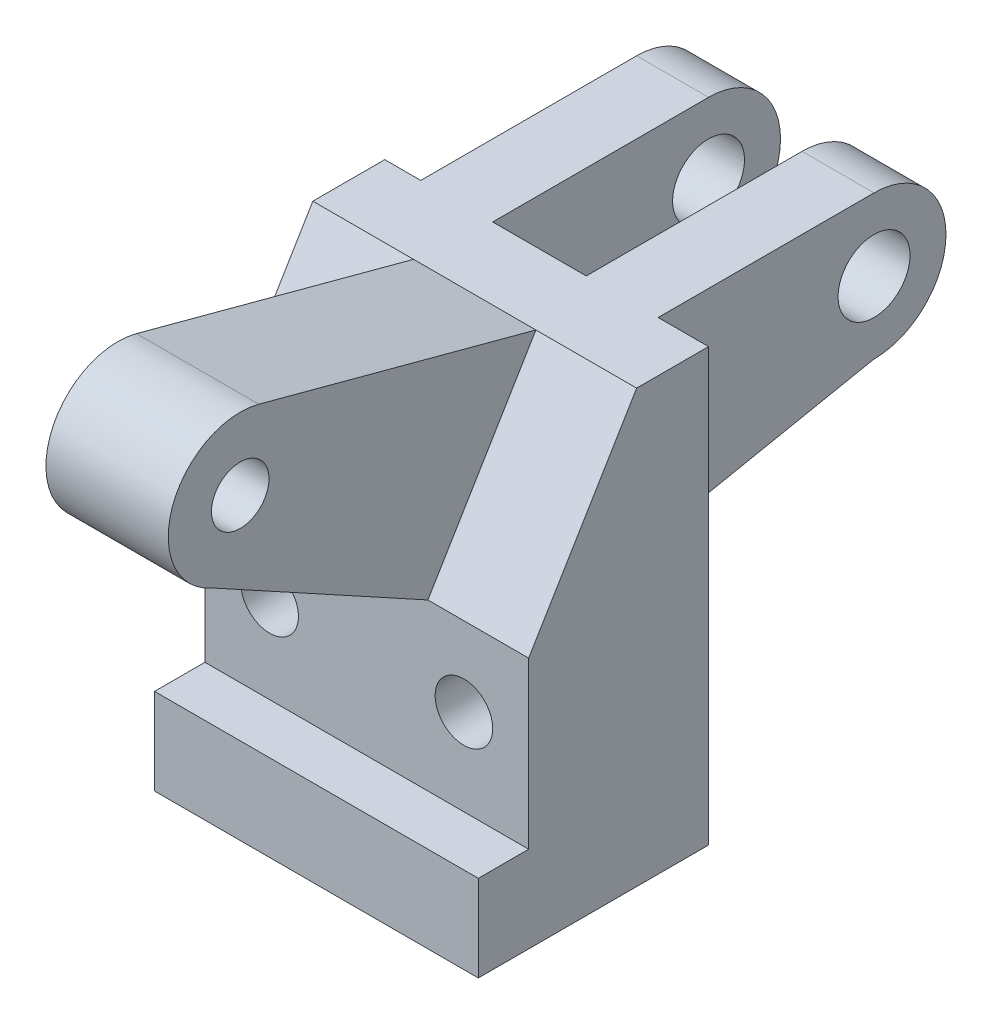
ISO-10303-21;
HEADER;
FILE_DESCRIPTION(('STEP AP214'),'2;1');
FILE_NAME('part.step','',(''),(''),'','','');
FILE_SCHEMA(('AUTOMOTIVE_DESIGN { 1 0 10303 214 1 1 1 1 }'));
ENDSEC;
DATA;
#1=APPLICATION_CONTEXT('core data for automotive mechanical design processes');
#2=APPLICATION_PROTOCOL_DEFINITION('international standard','automotive_design',2000,#1);
#3=PRODUCT_CONTEXT('',#1,'mechanical');
#4=PRODUCT('Part','Part','',(#3));
#5=PRODUCT_RELATED_PRODUCT_CATEGORY('part','',(#4));
#6=PRODUCT_DEFINITION_FORMATION('','',#4);
#7=PRODUCT_DEFINITION_CONTEXT('part definition',#1,'design');
#8=PRODUCT_DEFINITION('design','',#6,#7);
#9=PRODUCT_DEFINITION_SHAPE('','',#8);
#10=(LENGTH_UNIT() NAMED_UNIT(*) SI_UNIT(.MILLI.,.METRE.));
#11=(NAMED_UNIT(*) PLANE_ANGLE_UNIT() SI_UNIT($,.RADIAN.));
#12=(NAMED_UNIT(*) SI_UNIT($,.STERADIAN.) SOLID_ANGLE_UNIT());
#13=UNCERTAINTY_MEASURE_WITH_UNIT(LENGTH_MEASURE(1.E-05),#10,'distance_accuracy_value','');
#14=(GEOMETRIC_REPRESENTATION_CONTEXT(3) GLOBAL_UNCERTAINTY_ASSIGNED_CONTEXT((#13)) GLOBAL_UNIT_ASSIGNED_CONTEXT((#10,
#11,#12)) REPRESENTATION_CONTEXT('',''));
#15=CARTESIAN_POINT('',(0.,0.,0.));
#16=DIRECTION('',(0.,0.,1.));
#17=DIRECTION('',(1.,0.,0.));
#18=AXIS2_PLACEMENT_3D('',#15,#16,#17);
#19=CARTESIAN_POINT('',(1143.,1524.,254.));
#20=DIRECTION('',(0.,0.514495755427527,0.857492925712544));
#21=DIRECTION('',(0.,-0.857492925712544,0.514495755427527));
#22=AXIS2_PLACEMENT_3D('',#19,#20,#21);
#23=PLANE('',#22);
#24=DIRECTION('',(1.,0.,0.));
#25=VECTOR('',#24,1.);
#26=CARTESIAN_POINT('',(1143.,889.,635.));
#27=LINE('',#26,#25);
#28=CARTESIAN_POINT('',(0.,889.,635.));
#29=VERTEX_POINT('',#28);
#30=CARTESIAN_POINT('',(355.6,889.,635.));
#31=VERTEX_POINT('',#30);
#32=EDGE_CURVE('E215',#29,#31,#27,.T.);
#33=ORIENTED_EDGE('',*,*,#32,.T.);
#34=DIRECTION('',(0.,0.857492925712544,-0.514495755427527));
#35=VECTOR('',#34,1.);
#36=CARTESIAN_POINT('',(355.6,1524.,254.));
#37=LINE('',#36,#35);
#38=CARTESIAN_POINT('',(355.6,1524.,254.));
#39=VERTEX_POINT('',#38);
#40=EDGE_CURVE('E338',#31,#39,#37,.T.);
#41=ORIENTED_EDGE('',*,*,#40,.T.);
#42=DIRECTION('',(-1.,0.,0.));
#43=VECTOR('',#42,1.);
#44=CARTESIAN_POINT('',(1143.,1524.,254.));
#45=LINE('',#44,#43);
#46=CARTESIAN_POINT('',(0.,1524.,254.));
#47=VERTEX_POINT('',#46);
#48=EDGE_CURVE('E200',#39,#47,#45,.T.);
#49=ORIENTED_EDGE('',*,*,#48,.T.);
#50=DIRECTION('',(0.,0.857492925712544,-0.514495755427527));
#51=VECTOR('',#50,1.);
#52=CARTESIAN_POINT('',(0.,1524.,254.));
#53=LINE('',#52,#51);
#54=EDGE_CURVE('E303',#29,#47,#53,.T.);
#55=ORIENTED_EDGE('',*,*,#54,.F.);
#56=EDGE_LOOP('',(#33,#41,#49,#55));
#57=FACE_BOUND('',#56,.T.);
#58=ADVANCED_FACE('F39',(#57),#23,.T.);
#59=CARTESIAN_POINT('',(0.,584.2,0.));
#60=DIRECTION('',(0.,0.,1.));
#61=DIRECTION('',(1.,0.,0.));
#62=AXIS2_PLACEMENT_3D('',#59,#60,#61);
#63=PLANE('',#62);
#64=CARTESIAN_POINT('',(914.4,609.6,0.));
#65=DIRECTION('',(0.,0.,1.));
#66=DIRECTION('',(1.,0.,0.));
#67=AXIS2_PLACEMENT_3D('',#64,#65,#66);
#68=CIRCLE('',#67,101.6);
#69=CARTESIAN_POINT('',(1016.,609.6,0.));
#70=VERTEX_POINT('',#69);
#71=EDGE_CURVE('E365',#70,#70,#68,.T.);
#72=ORIENTED_EDGE('',*,*,#71,.T.);
#73=EDGE_LOOP('',(#72));
#74=FACE_BOUND('',#73,.T.);
#75=CARTESIAN_POINT('',(228.6,609.6,0.));
#76=DIRECTION('',(0.,0.,1.));
#77=DIRECTION('',(1.,0.,0.));
#78=AXIS2_PLACEMENT_3D('',#75,#76,#77);
#79=CIRCLE('',#78,101.6);
#80=CARTESIAN_POINT('',(330.2,609.6,0.));
#81=VERTEX_POINT('',#80);
#82=EDGE_CURVE('E360',#81,#81,#79,.T.);
#83=ORIENTED_EDGE('',*,*,#82,.T.);
#84=EDGE_LOOP('',(#83));
#85=FACE_BOUND('',#84,.T.);
#86=DIRECTION('',(0.,1.,0.));
#87=VECTOR('',#86,1.);
#88=CARTESIAN_POINT('',(965.2,863.6,0.));
#89=LINE('',#88,#87);
#90=CARTESIAN_POINT('',(965.2,863.6,0.));
#91=VERTEX_POINT('',#90);
#92=CARTESIAN_POINT('',(965.2,1524.,0.));
#93=VERTEX_POINT('',#92);
#94=EDGE_CURVE('E393',#91,#93,#89,.T.);
#95=ORIENTED_EDGE('',*,*,#94,.T.);
#96=DIRECTION('',(-1.,0.,0.));
#97=VECTOR('',#96,1.);
#98=CARTESIAN_POINT('',(1143.,1524.,0.));
#99=LINE('',#98,#97);
#100=CARTESIAN_POINT('',(1143.,1524.,0.));
#101=VERTEX_POINT('',#100);
#102=EDGE_CURVE('E211',#101,#93,#99,.T.);
#103=ORIENTED_EDGE('',*,*,#102,.F.);
#104=DIRECTION('',(0.,-1.,0.));
#105=VECTOR('',#104,1.);
#106=CARTESIAN_POINT('',(1143.,584.2,0.));
#107=LINE('',#106,#105);
#108=CARTESIAN_POINT('',(1143.,0.,0.));
#109=VERTEX_POINT('',#108);
#110=EDGE_CURVE('E249',#101,#109,#107,.T.);
#111=ORIENTED_EDGE('',*,*,#110,.T.);
#112=DIRECTION('',(-1.,0.,0.));
#113=VECTOR('',#112,1.);
#114=CARTESIAN_POINT('',(0.,0.,0.));
#115=LINE('',#114,#113);
#116=CARTESIAN_POINT('',(0.,0.,0.));
#117=VERTEX_POINT('',#116);
#118=EDGE_CURVE('E244',#109,#117,#115,.T.);
#119=ORIENTED_EDGE('',*,*,#118,.T.);
#120=DIRECTION('',(0.,-1.,0.));
#121=VECTOR('',#120,1.);
#122=CARTESIAN_POINT('',(0.,584.2,0.));
#123=LINE('',#122,#121);
#124=CARTESIAN_POINT('',(0.,1524.,0.));
#125=VERTEX_POINT('',#124);
#126=EDGE_CURVE('E246',#125,#117,#123,.T.);
#127=ORIENTED_EDGE('',*,*,#126,.F.);
#128=CARTESIAN_POINT('',(127.,1524.,0.));
#129=VERTEX_POINT('',#128);
#130=EDGE_CURVE('E207',#129,#125,#99,.T.);
#131=ORIENTED_EDGE('',*,*,#130,.F.);
#132=DIRECTION('',(0.,1.,0.));
#133=VECTOR('',#132,1.);
#134=CARTESIAN_POINT('',(127.,863.6,0.));
#135=LINE('',#134,#133);
#136=CARTESIAN_POINT('',(127.,863.6,0.));
#137=VERTEX_POINT('',#136);
#138=EDGE_CURVE('E296',#137,#129,#135,.T.);
#139=ORIENTED_EDGE('',*,*,#138,.F.);
#140=DIRECTION('',(-1.,0.,0.));
#141=VECTOR('',#140,1.);
#142=CARTESIAN_POINT('',(0.,863.6,0.));
#143=LINE('',#142,#141);
#144=CARTESIAN_POINT('',(381.,863.6,0.));
#145=VERTEX_POINT('',#144);
#146=EDGE_CURVE('E295',#145,#137,#143,.T.);
#147=ORIENTED_EDGE('',*,*,#146,.F.);
#148=DIRECTION('',(0.,1.,0.));
#149=VECTOR('',#148,1.);
#150=CARTESIAN_POINT('',(381.,863.6,0.));
#151=LINE('',#150,#149);
#152=CARTESIAN_POINT('',(381.,1524.,0.));
#153=VERTEX_POINT('',#152);
#154=EDGE_CURVE('E276',#145,#153,#151,.T.);
#155=ORIENTED_EDGE('',*,*,#154,.T.);
#156=CARTESIAN_POINT('',(711.2,1524.,0.));
#157=VERTEX_POINT('',#156);
#158=EDGE_CURVE('E209',#157,#153,#99,.T.);
#159=ORIENTED_EDGE('',*,*,#158,.F.);
#160=DIRECTION('',(0.,1.,0.));
#161=VECTOR('',#160,1.);
#162=CARTESIAN_POINT('',(711.2,863.6,0.));
#163=LINE('',#162,#161);
#164=CARTESIAN_POINT('',(711.2,863.6,0.));
#165=VERTEX_POINT('',#164);
#166=EDGE_CURVE('E386',#165,#157,#163,.T.);
#167=ORIENTED_EDGE('',*,*,#166,.F.);
#168=DIRECTION('',(-1.,0.,0.));
#169=VECTOR('',#168,1.);
#170=CARTESIAN_POINT('',(0.,863.6,0.));
#171=LINE('',#170,#169);
#172=EDGE_CURVE('E384',#91,#165,#171,.T.);
#173=ORIENTED_EDGE('',*,*,#172,.F.);
#174=EDGE_LOOP('',(#95,#103,#111,#119,#127,#131,#139,#147,#155,#159,#167,#173));
#175=FACE_BOUND('',#174,.T.);
#176=ADVANCED_FACE('F319',(#74,#85,#175),#63,.F.);
#177=CARTESIAN_POINT('',(0.,584.2,635.));
#178=DIRECTION('',(1.,0.,0.));
#179=DIRECTION('',(0.,0.,-1.));
#180=AXIS2_PLACEMENT_3D('',#177,#178,#179);
#181=PLANE('',#180);
#182=DIRECTION('',(0.,-1.,0.));
#183=VECTOR('',#182,1.);
#184=CARTESIAN_POINT('',(0.,584.2,635.));
#185=LINE('',#184,#183);
#186=CARTESIAN_POINT('',(0.,304.8,635.));
#187=VERTEX_POINT('',#186);
#188=EDGE_CURVE('E255',#29,#187,#185,.T.);
#189=ORIENTED_EDGE('',*,*,#188,.F.);
#190=ORIENTED_EDGE('',*,*,#54,.T.);
#191=DIRECTION('',(0.,0.,-1.));
#192=VECTOR('',#191,1.);
#193=CARTESIAN_POINT('',(0.,1524.,0.));
#194=LINE('',#193,#192);
#195=EDGE_CURVE('E306',#47,#125,#194,.T.);
#196=ORIENTED_EDGE('',*,*,#195,.T.);
#197=ORIENTED_EDGE('',*,*,#126,.T.);
#198=DIRECTION('',(0.,0.,1.));
#199=VECTOR('',#198,1.);
#200=CARTESIAN_POINT('',(0.,0.,635.));
#201=LINE('',#200,#199);
#202=CARTESIAN_POINT('',(0.,0.,812.8));
#203=VERTEX_POINT('',#202);
#204=EDGE_CURVE('E238',#117,#203,#201,.T.);
#205=ORIENTED_EDGE('',*,*,#204,.T.);
#206=DIRECTION('',(0.,-1.,0.));
#207=VECTOR('',#206,1.);
#208=CARTESIAN_POINT('',(0.,304.8,812.8));
#209=LINE('',#208,#207);
#210=CARTESIAN_POINT('',(0.,304.8,812.8));
#211=VERTEX_POINT('',#210);
#212=EDGE_CURVE('E235',#211,#203,#209,.T.);
#213=ORIENTED_EDGE('',*,*,#212,.F.);
#214=DIRECTION('',(0.,0.,-1.));
#215=VECTOR('',#214,1.);
#216=CARTESIAN_POINT('',(0.,304.8,812.8));
#217=LINE('',#216,#215);
#218=EDGE_CURVE('E229',#211,#187,#217,.T.);
#219=ORIENTED_EDGE('',*,*,#218,.T.);
#220=EDGE_LOOP('',(#189,#190,#196,#197,#205,#213,#219));
#221=FACE_BOUND('',#220,.T.);
#222=ADVANCED_FACE('F41',(#221),#181,.F.);
#223=CARTESIAN_POINT('',(1143.,584.2,635.));
#224=DIRECTION('',(0.,0.,-1.));
#225=DIRECTION('',(-1.,0.,0.));
#226=AXIS2_PLACEMENT_3D('',#223,#224,#225);
#227=PLANE('',#226);
#228=CARTESIAN_POINT('',(914.4,609.6,635.));
#229=DIRECTION('',(0.,0.,1.));
#230=DIRECTION('',(1.,0.,0.));
#231=AXIS2_PLACEMENT_3D('',#228,#229,#230);
#232=CIRCLE('',#231,101.6);
#233=CARTESIAN_POINT('',(1016.,609.6,635.));
#234=VERTEX_POINT('',#233);
#235=EDGE_CURVE('E357',#234,#234,#232,.T.);
#236=ORIENTED_EDGE('',*,*,#235,.F.);
#237=EDGE_LOOP('',(#236));
#238=FACE_BOUND('',#237,.T.);
#239=CARTESIAN_POINT('',(228.6,609.6,635.));
#240=DIRECTION('',(0.,0.,1.));
#241=DIRECTION('',(1.,0.,0.));
#242=AXIS2_PLACEMENT_3D('',#239,#240,#241);
#243=CIRCLE('',#242,101.6);
#244=CARTESIAN_POINT('',(330.2,609.6,635.));
#245=VERTEX_POINT('',#244);
#246=EDGE_CURVE('E353',#245,#245,#243,.T.);
#247=ORIENTED_EDGE('',*,*,#246,.F.);
#248=EDGE_LOOP('',(#247));
#249=FACE_BOUND('',#248,.T.);
#250=ORIENTED_EDGE('',*,*,#188,.T.);
#251=DIRECTION('',(1.,0.,0.));
#252=VECTOR('',#251,1.);
#253=CARTESIAN_POINT('',(0.,304.8,635.));
#254=LINE('',#253,#252);
#255=CARTESIAN_POINT('',(1143.,304.8,635.));
#256=VERTEX_POINT('',#255);
#257=EDGE_CURVE('E220',#187,#256,#254,.T.);
#258=ORIENTED_EDGE('',*,*,#257,.T.);
#259=DIRECTION('',(0.,-1.,0.));
#260=VECTOR('',#259,1.);
#261=CARTESIAN_POINT('',(1143.,584.2,635.));
#262=LINE('',#261,#260);
#263=CARTESIAN_POINT('',(1143.,889.,635.));
#264=VERTEX_POINT('',#263);
#265=EDGE_CURVE('E252',#264,#256,#262,.T.);
#266=ORIENTED_EDGE('',*,*,#265,.F.);
#267=CARTESIAN_POINT('',(787.4,889.,635.));
#268=VERTEX_POINT('',#267);
#269=EDGE_CURVE('E219',#268,#264,#27,.T.);
#270=ORIENTED_EDGE('',*,*,#269,.F.);
#271=DIRECTION('',(1.,0.,0.));
#272=VECTOR('',#271,1.);
#273=CARTESIAN_POINT('',(355.6,889.,635.));
#274=LINE('',#273,#272);
#275=EDGE_CURVE('E336',#31,#268,#274,.T.);
#276=ORIENTED_EDGE('',*,*,#275,.F.);
#277=ORIENTED_EDGE('',*,*,#32,.F.);
#278=EDGE_LOOP('',(#250,#258,#266,#270,#276,#277));
#279=FACE_BOUND('',#278,.T.);
#280=ADVANCED_FACE('F333',(#238,#249,#279),#227,.F.);
#281=CARTESIAN_POINT('',(1143.,584.2,0.));
#282=DIRECTION('',(-1.,0.,0.));
#283=DIRECTION('',(0.,0.,1.));
#284=AXIS2_PLACEMENT_3D('',#281,#282,#283);
#285=PLANE('',#284);
#286=DIRECTION('',(0.,0.,-1.));
#287=VECTOR('',#286,1.);
#288=CARTESIAN_POINT('',(1143.,0.,0.));
#289=LINE('',#288,#287);
#290=CARTESIAN_POINT('',(1143.,0.,812.8));
#291=VERTEX_POINT('',#290);
#292=EDGE_CURVE('E242',#291,#109,#289,.T.);
#293=ORIENTED_EDGE('',*,*,#292,.T.);
#294=ORIENTED_EDGE('',*,*,#110,.F.);
#295=DIRECTION('',(0.,0.,-1.));
#296=VECTOR('',#295,1.);
#297=CARTESIAN_POINT('',(1143.,1524.,0.));
#298=LINE('',#297,#296);
#299=CARTESIAN_POINT('',(1143.,1524.,254.));
#300=VERTEX_POINT('',#299);
#301=EDGE_CURVE('E212',#300,#101,#298,.T.);
#302=ORIENTED_EDGE('',*,*,#301,.F.);
#303=DIRECTION('',(0.,0.857492925712544,-0.514495755427527));
#304=VECTOR('',#303,1.);
#305=CARTESIAN_POINT('',(1143.,1524.,254.));
#306=LINE('',#305,#304);
#307=EDGE_CURVE('E206',#264,#300,#306,.T.);
#308=ORIENTED_EDGE('',*,*,#307,.F.);
#309=ORIENTED_EDGE('',*,*,#265,.T.);
#310=DIRECTION('',(0.,0.,1.));
#311=VECTOR('',#310,1.);
#312=CARTESIAN_POINT('',(1143.,304.8,635.));
#313=LINE('',#312,#311);
#314=CARTESIAN_POINT('',(1143.,304.8,812.8));
#315=VERTEX_POINT('',#314);
#316=EDGE_CURVE('E223',#256,#315,#313,.T.);
#317=ORIENTED_EDGE('',*,*,#316,.T.);
#318=DIRECTION('',(0.,-1.,0.));
#319=VECTOR('',#318,1.);
#320=CARTESIAN_POINT('',(1143.,304.8,812.8));
#321=LINE('',#320,#319);
#322=EDGE_CURVE('E232',#315,#291,#321,.T.);
#323=ORIENTED_EDGE('',*,*,#322,.T.);
#324=EDGE_LOOP('',(#293,#294,#302,#308,#309,#317,#323));
#325=FACE_BOUND('',#324,.T.);
#326=ADVANCED_FACE('F406',(#325),#285,.F.);
#327=CARTESIAN_POINT('',(0.,0.,0.));
#328=DIRECTION('',(0.,-1.,0.));
#329=DIRECTION('',(0.,0.,-1.));
#330=AXIS2_PLACEMENT_3D('',#327,#328,#329);
#331=PLANE('',#330);
#332=DIRECTION('',(-1.,0.,0.));
#333=VECTOR('',#332,1.);
#334=CARTESIAN_POINT('',(1143.,0.,812.8));
#335=LINE('',#334,#333);
#336=EDGE_CURVE('E218',#291,#203,#335,.T.);
#337=ORIENTED_EDGE('',*,*,#336,.T.);
#338=ORIENTED_EDGE('',*,*,#204,.F.);
#339=ORIENTED_EDGE('',*,*,#118,.F.);
#340=ORIENTED_EDGE('',*,*,#292,.F.);
#341=EDGE_LOOP('',(#337,#338,#339,#340));
#342=FACE_BOUND('',#341,.T.);
#343=ADVANCED_FACE('F323',(#342),#331,.T.);
#344=CARTESIAN_POINT('',(1143.,304.8,812.8));
#345=DIRECTION('',(0.,0.,1.));
#346=DIRECTION('',(1.,0.,0.));
#347=AXIS2_PLACEMENT_3D('',#344,#345,#346);
#348=PLANE('',#347);
#349=ORIENTED_EDGE('',*,*,#336,.F.);
#350=ORIENTED_EDGE('',*,*,#322,.F.);
#351=DIRECTION('',(-1.,0.,0.));
#352=VECTOR('',#351,1.);
#353=CARTESIAN_POINT('',(1143.,304.8,812.8));
#354=LINE('',#353,#352);
#355=EDGE_CURVE('E226',#315,#211,#354,.T.);
#356=ORIENTED_EDGE('',*,*,#355,.T.);
#357=ORIENTED_EDGE('',*,*,#212,.T.);
#358=EDGE_LOOP('',(#349,#350,#356,#357));
#359=FACE_BOUND('',#358,.T.);
#360=ADVANCED_FACE('F326',(#359),#348,.T.);
#361=CARTESIAN_POINT('',(0.,304.8,0.));
#362=DIRECTION('',(0.,-1.,0.));
#363=DIRECTION('',(0.,0.,-1.));
#364=AXIS2_PLACEMENT_3D('',#361,#362,#363);
#365=PLANE('',#364);
#366=ORIENTED_EDGE('',*,*,#257,.F.);
#367=ORIENTED_EDGE('',*,*,#218,.F.);
#368=ORIENTED_EDGE('',*,*,#355,.F.);
#369=ORIENTED_EDGE('',*,*,#316,.F.);
#370=EDGE_LOOP('',(#366,#367,#368,#369));
#371=FACE_BOUND('',#370,.T.);
#372=ADVANCED_FACE('F330',(#371),#365,.F.);
#373=CARTESIAN_POINT('',(1143.,1524.,0.));
#374=DIRECTION('',(0.,1.,0.));
#375=DIRECTION('',(0.,0.,1.));
#376=AXIS2_PLACEMENT_3D('',#373,#374,#375);
#377=PLANE('',#376);
#378=ORIENTED_EDGE('',*,*,#195,.F.);
#379=ORIENTED_EDGE('',*,*,#48,.F.);
#380=DIRECTION('',(1.,0.,0.));
#381=VECTOR('',#380,1.);
#382=CARTESIAN_POINT('',(355.6,1524.,254.));
#383=LINE('',#382,#381);
#384=CARTESIAN_POINT('',(787.4,1524.,254.));
#385=VERTEX_POINT('',#384);
#386=EDGE_CURVE('E173',#39,#385,#383,.T.);
#387=ORIENTED_EDGE('',*,*,#386,.T.);
#388=EDGE_CURVE('E198',#300,#385,#45,.T.);
#389=ORIENTED_EDGE('',*,*,#388,.F.);
#390=ORIENTED_EDGE('',*,*,#301,.T.);
#391=ORIENTED_EDGE('',*,*,#102,.T.);
#392=DIRECTION('',(0.,0.,1.));
#393=VECTOR('',#392,1.);
#394=CARTESIAN_POINT('',(965.2,1524.,0.));
#395=LINE('',#394,#393);
#396=CARTESIAN_POINT('',(965.2,1524.,-762.));
#397=VERTEX_POINT('',#396);
#398=EDGE_CURVE('E381',#397,#93,#395,.T.);
#399=ORIENTED_EDGE('',*,*,#398,.F.);
#400=DIRECTION('',(1.,0.,0.));
#401=VECTOR('',#400,1.);
#402=CARTESIAN_POINT('',(0.,1524.,-762.));
#403=LINE('',#402,#401);
#404=CARTESIAN_POINT('',(711.2,1524.,-762.));
#405=VERTEX_POINT('',#404);
#406=EDGE_CURVE('E389',#405,#397,#403,.T.);
#407=ORIENTED_EDGE('',*,*,#406,.F.);
#408=DIRECTION('',(0.,0.,-1.));
#409=VECTOR('',#408,1.);
#410=CARTESIAN_POINT('',(711.2,1524.,0.));
#411=LINE('',#410,#409);
#412=EDGE_CURVE('E387',#157,#405,#411,.T.);
#413=ORIENTED_EDGE('',*,*,#412,.F.);
#414=ORIENTED_EDGE('',*,*,#158,.T.);
#415=DIRECTION('',(0.,0.,1.));
#416=VECTOR('',#415,1.);
#417=CARTESIAN_POINT('',(381.,1524.,0.));
#418=LINE('',#417,#416);
#419=CARTESIAN_POINT('',(381.,1524.,-762.));
#420=VERTEX_POINT('',#419);
#421=EDGE_CURVE('E283',#420,#153,#418,.T.);
#422=ORIENTED_EDGE('',*,*,#421,.F.);
#423=DIRECTION('',(1.,0.,0.));
#424=VECTOR('',#423,1.);
#425=CARTESIAN_POINT('',(0.,1524.,-762.));
#426=LINE('',#425,#424);
#427=CARTESIAN_POINT('',(127.,1524.,-762.));
#428=VERTEX_POINT('',#427);
#429=EDGE_CURVE('E282',#428,#420,#426,.T.);
#430=ORIENTED_EDGE('',*,*,#429,.F.);
#431=DIRECTION('',(0.,0.,-1.));
#432=VECTOR('',#431,1.);
#433=CARTESIAN_POINT('',(127.,1524.,0.));
#434=LINE('',#433,#432);
#435=EDGE_CURVE('E297',#129,#428,#434,.T.);
#436=ORIENTED_EDGE('',*,*,#435,.F.);
#437=ORIENTED_EDGE('',*,*,#130,.T.);
#438=EDGE_LOOP('',(#378,#379,#387,#389,#390,#391,#399,#407,#413,#414,#422,#430,#436,#437));
#439=FACE_BOUND('',#438,.T.);
#440=ADVANCED_FACE('F196',(#439),#377,.T.);
#441=DIRECTION('',(0.,0.857492925712544,-0.514495755427527));
#442=VECTOR('',#441,1.);
#443=CARTESIAN_POINT('',(787.4,1524.,254.));
#444=LINE('',#443,#442);
#445=EDGE_CURVE('E180',#268,#385,#444,.T.);
#446=ORIENTED_EDGE('',*,*,#445,.F.);
#447=ORIENTED_EDGE('',*,*,#269,.T.);
#448=ORIENTED_EDGE('',*,*,#307,.T.);
#449=ORIENTED_EDGE('',*,*,#388,.T.);
#450=EDGE_LOOP('',(#446,#447,#448,#449));
#451=FACE_BOUND('',#450,.T.);
#452=ADVANCED_FACE('F204',(#451),#23,.T.);
#453=CARTESIAN_POINT('',(381.,863.6,0.));
#454=DIRECTION('',(-1.,0.,0.));
#455=DIRECTION('',(0.,0.,1.));
#456=AXIS2_PLACEMENT_3D('',#453,#454,#455);
#457=PLANE('',#456);
#458=ORIENTED_EDGE('',*,*,#154,.F.);
#459=DIRECTION('',(0.,0.196116135138184,-0.98058067569092));
#460=VECTOR('',#459,1.);
#461=CARTESIAN_POINT('',(381.,863.6,0.));
#462=LINE('',#461,#460);
#463=CARTESIAN_POINT('',(381.,1016.,-762.));
#464=VERTEX_POINT('',#463);
#465=EDGE_CURVE('E261',#145,#464,#462,.T.);
#466=ORIENTED_EDGE('',*,*,#465,.T.);
#467=CARTESIAN_POINT('',(381.,1270.,-762.));
#468=DIRECTION('',(-1.,0.,0.));
#469=DIRECTION('',(0.,0.,1.));
#470=AXIS2_PLACEMENT_3D('',#467,#468,#469);
#471=CIRCLE('',#470,254.);
#472=EDGE_CURVE('E274',#420,#464,#471,.T.);
#473=ORIENTED_EDGE('',*,*,#472,.F.);
#474=ORIENTED_EDGE('',*,*,#421,.T.);
#475=EDGE_LOOP('',(#458,#466,#473,#474));
#476=FACE_BOUND('',#475,.T.);
#477=CARTESIAN_POINT('',(381.,1270.,-762.));
#478=DIRECTION('',(-1.,0.,0.));
#479=DIRECTION('',(0.,0.,1.));
#480=AXIS2_PLACEMENT_3D('',#477,#478,#479);
#481=CIRCLE('',#480,127.);
#482=CARTESIAN_POINT('',(381.,1270.,-635.));
#483=VERTEX_POINT('',#482);
#484=EDGE_CURVE('E284',#483,#483,#481,.T.);
#485=ORIENTED_EDGE('',*,*,#484,.T.);
#486=EDGE_LOOP('',(#485));
#487=FACE_BOUND('',#486,.T.);
#488=ADVANCED_FACE('F271',(#476,#487),#457,.F.);
#489=CARTESIAN_POINT('',(127.,863.6,0.));
#490=DIRECTION('',(1.,0.,0.));
#491=DIRECTION('',(0.,0.,-1.));
#492=AXIS2_PLACEMENT_3D('',#489,#490,#491);
#493=PLANE('',#492);
#494=CARTESIAN_POINT('',(127.,1270.,-762.));
#495=DIRECTION('',(-1.,0.,0.));
#496=DIRECTION('',(0.,0.,1.));
#497=AXIS2_PLACEMENT_3D('',#494,#495,#496);
#498=CIRCLE('',#497,254.);
#499=CARTESIAN_POINT('',(127.,1016.,-762.));
#500=VERTEX_POINT('',#499);
#501=EDGE_CURVE('E288',#428,#500,#498,.T.);
#502=ORIENTED_EDGE('',*,*,#501,.T.);
#503=DIRECTION('',(0.,0.196116135138184,-0.98058067569092));
#504=VECTOR('',#503,1.);
#505=CARTESIAN_POINT('',(127.,863.6,0.));
#506=LINE('',#505,#504);
#507=EDGE_CURVE('E264',#137,#500,#506,.T.);
#508=ORIENTED_EDGE('',*,*,#507,.F.);
#509=ORIENTED_EDGE('',*,*,#138,.T.);
#510=ORIENTED_EDGE('',*,*,#435,.T.);
#511=EDGE_LOOP('',(#502,#508,#509,#510));
#512=FACE_BOUND('',#511,.T.);
#513=CARTESIAN_POINT('',(127.,1270.,-762.));
#514=DIRECTION('',(-1.,0.,0.));
#515=DIRECTION('',(0.,0.,1.));
#516=AXIS2_PLACEMENT_3D('',#513,#514,#515);
#517=CIRCLE('',#516,127.);
#518=CARTESIAN_POINT('',(127.,1270.,-635.));
#519=VERTEX_POINT('',#518);
#520=EDGE_CURVE('E278',#519,#519,#517,.T.);
#521=ORIENTED_EDGE('',*,*,#520,.F.);
#522=EDGE_LOOP('',(#521));
#523=FACE_BOUND('',#522,.T.);
#524=ADVANCED_FACE('F443',(#512,#523),#493,.F.);
#525=CARTESIAN_POINT('',(381.,1270.,-762.));
#526=DIRECTION('',(-1.,0.,0.));
#527=DIRECTION('',(0.,0.,1.));
#528=AXIS2_PLACEMENT_3D('',#525,#526,#527);
#529=CYLINDRICAL_SURFACE('',#528,127.);
#530=ORIENTED_EDGE('',*,*,#520,.T.);
#531=EDGE_LOOP('',(#530));
#532=FACE_BOUND('',#531,.T.);
#533=ORIENTED_EDGE('',*,*,#484,.F.);
#534=EDGE_LOOP('',(#533));
#535=FACE_BOUND('',#534,.T.);
#536=ADVANCED_FACE('F615',(#532,#535),#529,.F.);
#537=CARTESIAN_POINT('',(381.,1270.,-762.));
#538=DIRECTION('',(-1.,0.,0.));
#539=DIRECTION('',(0.,0.,1.));
#540=AXIS2_PLACEMENT_3D('',#537,#538,#539);
#541=CYLINDRICAL_SURFACE('',#540,254.);
#542=ORIENTED_EDGE('',*,*,#429,.T.);
#543=ORIENTED_EDGE('',*,*,#472,.T.);
#544=DIRECTION('',(-1.,0.,0.));
#545=VECTOR('',#544,1.);
#546=CARTESIAN_POINT('',(381.,1016.,-762.));
#547=LINE('',#546,#545);
#548=EDGE_CURVE('E47',#500,#464,#547,.F.);
#549=ORIENTED_EDGE('',*,*,#548,.F.);
#550=ORIENTED_EDGE('',*,*,#501,.F.);
#551=EDGE_LOOP('',(#542,#543,#549,#550));
#552=FACE_BOUND('',#551,.T.);
#553=ADVANCED_FACE('F281',(#552),#541,.T.);
#554=CARTESIAN_POINT('',(381.,863.6,0.));
#555=DIRECTION('',(0.,0.98058067569092,0.196116135138184));
#556=DIRECTION('',(0.,-0.196116135138184,0.98058067569092));
#557=AXIS2_PLACEMENT_3D('',#554,#555,#556);
#558=PLANE('',#557);
#559=ORIENTED_EDGE('',*,*,#507,.T.);
#560=ORIENTED_EDGE('',*,*,#548,.T.);
#561=ORIENTED_EDGE('',*,*,#465,.F.);
#562=ORIENTED_EDGE('',*,*,#146,.T.);
#563=EDGE_LOOP('',(#559,#560,#561,#562));
#564=FACE_BOUND('',#563,.T.);
#565=ADVANCED_FACE('F260',(#564),#558,.F.);
#566=CARTESIAN_POINT('',(965.2,863.6,0.));
#567=DIRECTION('',(-1.,0.,0.));
#568=DIRECTION('',(0.,0.,1.));
#569=AXIS2_PLACEMENT_3D('',#566,#567,#568);
#570=PLANE('',#569);
#571=ORIENTED_EDGE('',*,*,#94,.F.);
#572=DIRECTION('',(0.,-0.196116135138184,0.98058067569092));
#573=VECTOR('',#572,1.);
#574=CARTESIAN_POINT('',(965.2,1016.,-762.));
#575=LINE('',#574,#573);
#576=CARTESIAN_POINT('',(965.2,1016.,-762.));
#577=VERTEX_POINT('',#576);
#578=EDGE_CURVE('E368',#577,#91,#575,.T.);
#579=ORIENTED_EDGE('',*,*,#578,.F.);
#580=CARTESIAN_POINT('',(965.2,1270.,-762.));
#581=DIRECTION('',(1.,0.,0.));
#582=DIRECTION('',(0.,0.,-1.));
#583=AXIS2_PLACEMENT_3D('',#580,#581,#582);
#584=CIRCLE('',#583,254.);
#585=EDGE_CURVE('E375',#577,#397,#584,.T.);
#586=ORIENTED_EDGE('',*,*,#585,.T.);
#587=ORIENTED_EDGE('',*,*,#398,.T.);
#588=EDGE_LOOP('',(#571,#579,#586,#587));
#589=FACE_BOUND('',#588,.T.);
#590=CARTESIAN_POINT('',(965.2,1270.,-762.));
#591=DIRECTION('',(1.,0.,0.));
#592=DIRECTION('',(0.,0.,-1.));
#593=AXIS2_PLACEMENT_3D('',#590,#591,#592);
#594=CIRCLE('',#593,127.);
#595=CARTESIAN_POINT('',(965.2,1270.,-889.));
#596=VERTEX_POINT('',#595);
#597=EDGE_CURVE('E370',#596,#596,#594,.T.);
#598=ORIENTED_EDGE('',*,*,#597,.F.);
#599=EDGE_LOOP('',(#598));
#600=FACE_BOUND('',#599,.T.);
#601=ADVANCED_FACE('F410',(#589,#600),#570,.F.);
#602=CARTESIAN_POINT('',(711.2,863.6,0.));
#603=DIRECTION('',(1.,0.,0.));
#604=DIRECTION('',(0.,0.,-1.));
#605=AXIS2_PLACEMENT_3D('',#602,#603,#604);
#606=PLANE('',#605);
#607=CARTESIAN_POINT('',(711.2,1270.,-762.));
#608=DIRECTION('',(1.,0.,0.));
#609=DIRECTION('',(0.,0.,-1.));
#610=AXIS2_PLACEMENT_3D('',#607,#608,#609);
#611=CIRCLE('',#610,254.);
#612=CARTESIAN_POINT('',(711.2,1016.,-762.));
#613=VERTEX_POINT('',#612);
#614=EDGE_CURVE('E378',#613,#405,#611,.T.);
#615=ORIENTED_EDGE('',*,*,#614,.F.);
#616=DIRECTION('',(0.,-0.196116135138184,0.98058067569092));
#617=VECTOR('',#616,1.);
#618=CARTESIAN_POINT('',(711.2,1016.,-762.));
#619=LINE('',#618,#617);
#620=EDGE_CURVE('E61',#613,#165,#619,.T.);
#621=ORIENTED_EDGE('',*,*,#620,.T.);
#622=ORIENTED_EDGE('',*,*,#166,.T.);
#623=ORIENTED_EDGE('',*,*,#412,.T.);
#624=EDGE_LOOP('',(#615,#621,#622,#623));
#625=FACE_BOUND('',#624,.T.);
#626=CARTESIAN_POINT('',(711.2,1270.,-762.));
#627=DIRECTION('',(1.,0.,0.));
#628=DIRECTION('',(0.,0.,-1.));
#629=AXIS2_PLACEMENT_3D('',#626,#627,#628);
#630=CIRCLE('',#629,127.);
#631=CARTESIAN_POINT('',(711.2,1270.,-889.));
#632=VERTEX_POINT('',#631);
#633=EDGE_CURVE('E372',#632,#632,#630,.T.);
#634=ORIENTED_EDGE('',*,*,#633,.T.);
#635=EDGE_LOOP('',(#634));
#636=FACE_BOUND('',#635,.T.);
#637=ADVANCED_FACE('F400',(#625,#636),#606,.F.);
#638=CARTESIAN_POINT('',(711.2,1270.,-762.));
#639=DIRECTION('',(1.,0.,0.));
#640=DIRECTION('',(0.,0.,-1.));
#641=AXIS2_PLACEMENT_3D('',#638,#639,#640);
#642=CYLINDRICAL_SURFACE('',#641,254.);
#643=DIRECTION('',(1.,0.,0.));
#644=VECTOR('',#643,1.);
#645=CARTESIAN_POINT('',(711.2,1016.,-762.));
#646=LINE('',#645,#644);
#647=EDGE_CURVE('E11',#613,#577,#646,.T.);
#648=ORIENTED_EDGE('',*,*,#647,.F.);
#649=ORIENTED_EDGE('',*,*,#614,.T.);
#650=ORIENTED_EDGE('',*,*,#406,.T.);
#651=ORIENTED_EDGE('',*,*,#585,.F.);
#652=EDGE_LOOP('',(#648,#649,#650,#651));
#653=FACE_BOUND('',#652,.T.);
#654=ADVANCED_FACE('F414',(#653),#642,.T.);
#655=CARTESIAN_POINT('',(711.2,1270.,-762.));
#656=DIRECTION('',(1.,0.,0.));
#657=DIRECTION('',(0.,0.,-1.));
#658=AXIS2_PLACEMENT_3D('',#655,#656,#657);
#659=CYLINDRICAL_SURFACE('',#658,127.);
#660=ORIENTED_EDGE('',*,*,#597,.T.);
#661=EDGE_LOOP('',(#660));
#662=FACE_BOUND('',#661,.T.);
#663=ORIENTED_EDGE('',*,*,#633,.F.);
#664=EDGE_LOOP('',(#663));
#665=FACE_BOUND('',#664,.T.);
#666=ADVANCED_FACE('F418',(#662,#665),#659,.F.);
#667=CARTESIAN_POINT('',(711.2,1016.,-762.));
#668=DIRECTION('',(0.,0.98058067569092,0.196116135138184));
#669=DIRECTION('',(0.,-0.196116135138184,0.98058067569092));
#670=AXIS2_PLACEMENT_3D('',#667,#668,#669);
#671=PLANE('',#670);
#672=ORIENTED_EDGE('',*,*,#578,.T.);
#673=ORIENTED_EDGE('',*,*,#172,.T.);
#674=ORIENTED_EDGE('',*,*,#620,.F.);
#675=ORIENTED_EDGE('',*,*,#647,.T.);
#676=EDGE_LOOP('',(#672,#673,#674,#675));
#677=FACE_BOUND('',#676,.T.);
#678=ADVANCED_FACE('F415',(#677),#671,.F.);
#679=CARTESIAN_POINT('',(228.6,609.6,-1016.));
#680=DIRECTION('',(0.,0.,1.));
#681=DIRECTION('',(1.,0.,0.));
#682=AXIS2_PLACEMENT_3D('',#679,#680,#681);
#683=CYLINDRICAL_SURFACE('',#682,101.6);
#684=ORIENTED_EDGE('',*,*,#246,.T.);
#685=EDGE_LOOP('',(#684));
#686=FACE_BOUND('',#685,.T.);
#687=ORIENTED_EDGE('',*,*,#82,.F.);
#688=EDGE_LOOP('',(#687));
#689=FACE_BOUND('',#688,.T.);
#690=ADVANCED_FACE('F417',(#686,#689),#683,.F.);
#691=CARTESIAN_POINT('',(914.4,609.6,-1016.));
#692=DIRECTION('',(0.,0.,1.));
#693=DIRECTION('',(1.,0.,0.));
#694=AXIS2_PLACEMENT_3D('',#691,#692,#693);
#695=CYLINDRICAL_SURFACE('',#694,101.6);
#696=ORIENTED_EDGE('',*,*,#235,.T.);
#697=EDGE_LOOP('',(#696));
#698=FACE_BOUND('',#697,.T.);
#699=ORIENTED_EDGE('',*,*,#71,.F.);
#700=EDGE_LOOP('',(#699));
#701=FACE_BOUND('',#700,.T.);
#702=ADVANCED_FACE('F424',(#698,#701),#695,.F.);
#703=CARTESIAN_POINT('',(355.6,889.,635.));
#704=DIRECTION('',(0.,-0.876882035080919,0.480705623591347));
#705=DIRECTION('',(0.,-0.480705623591347,-0.876882035080919));
#706=AXIS2_PLACEMENT_3D('',#703,#704,#705);
#707=PLANE('',#706);
#708=ORIENTED_EDGE('',*,*,#275,.T.);
#709=DIRECTION('',(0.,-0.480705623591347,-0.876882035080919));
#710=VECTOR('',#709,1.);
#711=CARTESIAN_POINT('',(787.4,889.,635.));
#712=LINE('',#711,#710);
#713=CARTESIAN_POINT('',(787.4,1307.23821328859,1397.93173538756));
#714=VERTEX_POINT('',#713);
#715=EDGE_CURVE('E187',#714,#268,#712,.T.);
#716=ORIENTED_EDGE('',*,*,#715,.F.);
#717=DIRECTION('',(1.,0.,0.));
#718=VECTOR('',#717,1.);
#719=CARTESIAN_POINT('',(355.6,1307.23821328859,1397.93173538756));
#720=LINE('',#719,#718);
#721=CARTESIAN_POINT('',(355.6,1307.23821328859,1397.93173538756));
#722=VERTEX_POINT('',#721);
#723=EDGE_CURVE('E354',#722,#714,#720,.T.);
#724=ORIENTED_EDGE('',*,*,#723,.F.);
#725=DIRECTION('',(0.,-0.480705623591347,-0.876882035080919));
#726=VECTOR('',#725,1.);
#727=CARTESIAN_POINT('',(355.6,889.,635.));
#728=LINE('',#727,#726);
#729=EDGE_CURVE('E201',#722,#31,#728,.T.);
#730=ORIENTED_EDGE('',*,*,#729,.T.);
#731=EDGE_LOOP('',(#708,#716,#724,#730));
#732=FACE_BOUND('',#731,.T.);
#733=ADVANCED_FACE('F468',(#732),#707,.T.);
#734=CARTESIAN_POINT('',(355.6,1540.63914300116,1297.73190500194));
#735=DIRECTION('',(1.,0.,0.));
#736=DIRECTION('',(0.,0.,-1.));
#737=AXIS2_PLACEMENT_3D('',#734,#735,#736);
#738=CYLINDRICAL_SURFACE('',#737,254.);
#739=ORIENTED_EDGE('',*,*,#723,.T.);
#740=CARTESIAN_POINT('',(787.4,1540.63914300116,1297.73190500194));
#741=DIRECTION('',(1.,0.,0.));
#742=DIRECTION('',(0.,0.,-1.));
#743=AXIS2_PLACEMENT_3D('',#740,#741,#742);
#744=CIRCLE('',#743,254.);
#745=CARTESIAN_POINT('',(787.4,1785.98855635798,1232.00774380179));
#746=VERTEX_POINT('',#745);
#747=EDGE_CURVE('E179',#746,#714,#744,.T.);
#748=ORIENTED_EDGE('',*,*,#747,.F.);
#749=DIRECTION('',(1.,0.,0.));
#750=VECTOR('',#749,1.);
#751=CARTESIAN_POINT('',(355.6,1785.98855635798,1232.00774380179));
#752=LINE('',#751,#750);
#753=CARTESIAN_POINT('',(355.6,1785.98855635798,1232.00774380179));
#754=VERTEX_POINT('',#753);
#755=EDGE_CURVE('E175',#754,#746,#752,.T.);
#756=ORIENTED_EDGE('',*,*,#755,.F.);
#757=CARTESIAN_POINT('',(355.6,1540.63914300116,1297.73190500194));
#758=DIRECTION('',(1.,0.,0.));
#759=DIRECTION('',(0.,0.,-1.));
#760=AXIS2_PLACEMENT_3D('',#757,#758,#759);
#761=CIRCLE('',#760,254.);
#762=EDGE_CURVE('E343',#754,#722,#761,.T.);
#763=ORIENTED_EDGE('',*,*,#762,.T.);
#764=EDGE_LOOP('',(#739,#748,#756,#763));
#765=FACE_BOUND('',#764,.T.);
#766=ADVANCED_FACE('F474',(#765),#738,.T.);
#767=CARTESIAN_POINT('',(355.6,1524.,254.));
#768=DIRECTION('',(0.,0.965942572270944,-0.258756540158101));
#769=DIRECTION('',(0.,0.258756540158101,0.965942572270945));
#770=AXIS2_PLACEMENT_3D('',#767,#768,#769);
#771=PLANE('',#770);
#772=ORIENTED_EDGE('',*,*,#755,.T.);
#773=DIRECTION('',(0.,0.258756540158101,0.965942572270944));
#774=VECTOR('',#773,1.);
#775=CARTESIAN_POINT('',(787.4,1524.,254.));
#776=LINE('',#775,#774);
#777=EDGE_CURVE('E169',#385,#746,#776,.T.);
#778=ORIENTED_EDGE('',*,*,#777,.F.);
#779=ORIENTED_EDGE('',*,*,#386,.F.);
#780=DIRECTION('',(0.,0.258756540158101,0.965942572270944));
#781=VECTOR('',#780,1.);
#782=CARTESIAN_POINT('',(355.6,1524.,254.));
#783=LINE('',#782,#781);
#784=EDGE_CURVE('E54',#39,#754,#783,.T.);
#785=ORIENTED_EDGE('',*,*,#784,.T.);
#786=EDGE_LOOP('',(#772,#778,#779,#785));
#787=FACE_BOUND('',#786,.T.);
#788=ADVANCED_FACE('F171',(#787),#771,.T.);
#789=CARTESIAN_POINT('',(355.6,1540.63914300116,1297.73190500194));
#790=DIRECTION('',(1.,0.,0.));
#791=DIRECTION('',(0.,0.,-1.));
#792=AXIS2_PLACEMENT_3D('',#789,#790,#791);
#793=PLANE('',#792);
#794=CARTESIAN_POINT('',(355.6,1540.63914300116,1297.73190500194));
#795=DIRECTION('',(1.,0.,0.));
#796=DIRECTION('',(0.,0.,-1.));
#797=AXIS2_PLACEMENT_3D('',#794,#795,#796);
#798=CIRCLE('',#797,101.6);
#799=CARTESIAN_POINT('',(355.6,1540.63914300116,1196.13190500194));
#800=VERTEX_POINT('',#799);
#801=EDGE_CURVE('E341',#800,#800,#798,.T.);
#802=ORIENTED_EDGE('',*,*,#801,.T.);
#803=EDGE_LOOP('',(#802));
#804=FACE_BOUND('',#803,.T.);
#805=ORIENTED_EDGE('',*,*,#40,.F.);
#806=ORIENTED_EDGE('',*,*,#729,.F.);
#807=ORIENTED_EDGE('',*,*,#762,.F.);
#808=ORIENTED_EDGE('',*,*,#784,.F.);
#809=EDGE_LOOP('',(#805,#806,#807,#808));
#810=FACE_BOUND('',#809,.T.);
#811=ADVANCED_FACE('F480',(#804,#810),#793,.F.);
#812=CARTESIAN_POINT('',(355.6,1540.63914300116,1297.73190500194));
#813=DIRECTION('',(1.,0.,0.));
#814=DIRECTION('',(0.,0.,-1.));
#815=AXIS2_PLACEMENT_3D('',#812,#813,#814);
#816=CYLINDRICAL_SURFACE('',#815,101.6);
#817=ORIENTED_EDGE('',*,*,#801,.F.);
#818=EDGE_LOOP('',(#817));
#819=FACE_BOUND('',#818,.T.);
#820=CARTESIAN_POINT('',(787.4,1540.63914300116,1297.73190500194));
#821=DIRECTION('',(1.,0.,0.));
#822=DIRECTION('',(0.,0.,-1.));
#823=AXIS2_PLACEMENT_3D('',#820,#821,#822);
#824=CIRCLE('',#823,101.6);
#825=CARTESIAN_POINT('',(787.4,1540.63914300116,1196.13190500194));
#826=VERTEX_POINT('',#825);
#827=EDGE_CURVE('E191',#826,#826,#824,.T.);
#828=ORIENTED_EDGE('',*,*,#827,.T.);
#829=EDGE_LOOP('',(#828));
#830=FACE_BOUND('',#829,.T.);
#831=ADVANCED_FACE('F486',(#819,#830),#816,.F.);
#832=CARTESIAN_POINT('',(787.4,1540.63914300116,1297.73190500194));
#833=DIRECTION('',(1.,0.,0.));
#834=DIRECTION('',(0.,0.,-1.));
#835=AXIS2_PLACEMENT_3D('',#832,#833,#834);
#836=PLANE('',#835);
#837=ORIENTED_EDGE('',*,*,#445,.T.);
#838=ORIENTED_EDGE('',*,*,#777,.T.);
#839=ORIENTED_EDGE('',*,*,#747,.T.);
#840=ORIENTED_EDGE('',*,*,#715,.T.);
#841=EDGE_LOOP('',(#837,#838,#839,#840));
#842=FACE_BOUND('',#841,.T.);
#843=ORIENTED_EDGE('',*,*,#827,.F.);
#844=EDGE_LOOP('',(#843));
#845=FACE_BOUND('',#844,.T.);
#846=ADVANCED_FACE('F184',(#842,#845),#836,.T.);
#847=CLOSED_SHELL('',(#58,#176,#222,#280,#326,#343,#360,#372,#440,#452,#488,#524,#536,#553,#565,
#601,#637,#654,#666,#678,#690,#702,#733,#766,#788,#811,#831,#846));
#848=MANIFOLD_SOLID_BREP('B2',#847);
#849=ADVANCED_BREP_SHAPE_REPRESENTATION('',(#18,#848),#14);
#850=SHAPE_DEFINITION_REPRESENTATION(#9,#849);
ENDSEC;
END-ISO-10303-21;
